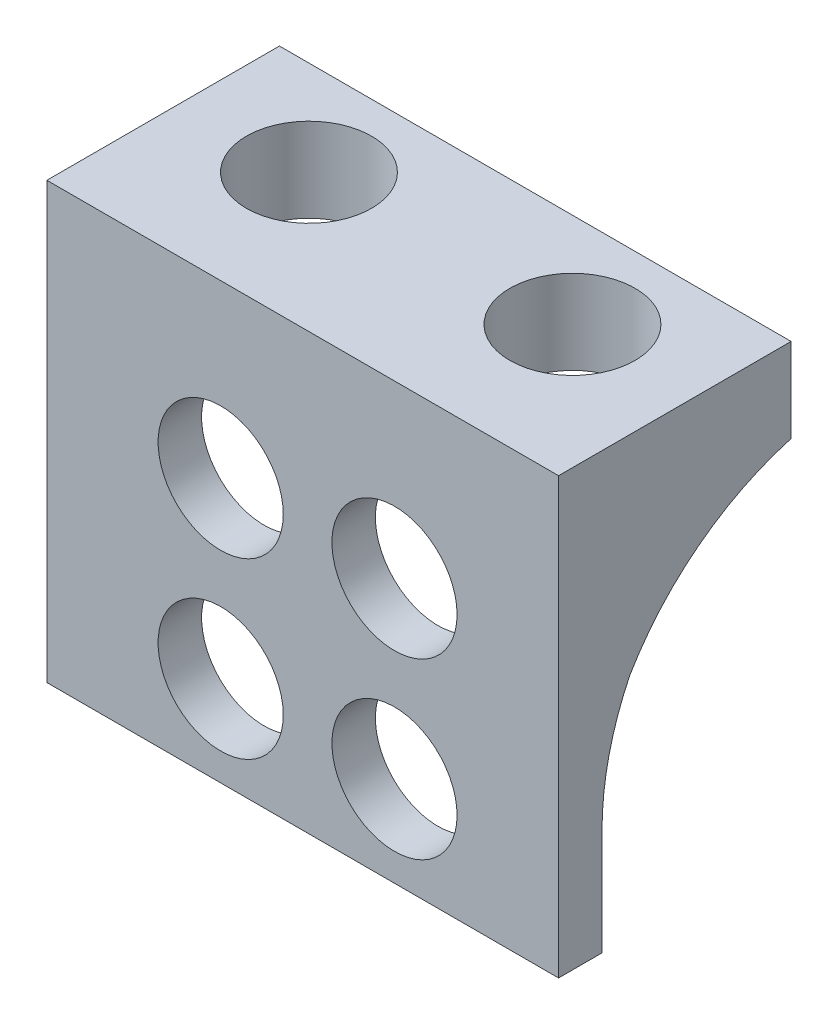
ISO-10303-21;
HEADER;
FILE_DESCRIPTION(('STEP AP214'),'2;1');
FILE_NAME('part.step','',(''),(''),'','','');
FILE_SCHEMA(('AUTOMOTIVE_DESIGN { 1 0 10303 214 1 1 1 1 }'));
ENDSEC;
DATA;
#1=APPLICATION_CONTEXT('core data for automotive mechanical design processes');
#2=APPLICATION_PROTOCOL_DEFINITION('international standard','automotive_design',2000,#1);
#3=PRODUCT_CONTEXT('',#1,'mechanical');
#4=PRODUCT('Part','Part','',(#3));
#5=PRODUCT_RELATED_PRODUCT_CATEGORY('part','',(#4));
#6=PRODUCT_DEFINITION_FORMATION('','',#4);
#7=PRODUCT_DEFINITION_CONTEXT('part definition',#1,'design');
#8=PRODUCT_DEFINITION('design','',#6,#7);
#9=PRODUCT_DEFINITION_SHAPE('','',#8);
#10=(LENGTH_UNIT() NAMED_UNIT(*) SI_UNIT(.MILLI.,.METRE.));
#11=(NAMED_UNIT(*) PLANE_ANGLE_UNIT() SI_UNIT($,.RADIAN.));
#12=(NAMED_UNIT(*) SI_UNIT($,.STERADIAN.) SOLID_ANGLE_UNIT());
#13=UNCERTAINTY_MEASURE_WITH_UNIT(LENGTH_MEASURE(1.E-05),#10,'distance_accuracy_value','');
#14=(GEOMETRIC_REPRESENTATION_CONTEXT(3) GLOBAL_UNCERTAINTY_ASSIGNED_CONTEXT((#13)) GLOBAL_UNIT_ASSIGNED_CONTEXT((#10,
#11,#12)) REPRESENTATION_CONTEXT('',''));
#15=CARTESIAN_POINT('',(0.,0.,0.));
#16=DIRECTION('',(0.,0.,1.));
#17=DIRECTION('',(1.,0.,0.));
#18=AXIS2_PLACEMENT_3D('',#15,#16,#17);
#19=CARTESIAN_POINT('',(0.,3.0734,0.));
#20=DIRECTION('',(0.,1.,0.));
#21=DIRECTION('',(0.,0.,1.));
#22=AXIS2_PLACEMENT_3D('',#19,#20,#21);
#23=PLANE('',#22);
#24=CARTESIAN_POINT('',(14.1605,3.0734,3.4544));
#25=DIRECTION('',(0.,1.,0.));
#26=DIRECTION('',(0.,0.,1.));
#27=AXIS2_PLACEMENT_3D('',#24,#25,#26);
#28=CIRCLE('',#27,2.286);
#29=CARTESIAN_POINT('',(14.1605,3.0734,5.7404));
#30=VERTEX_POINT('',#29);
#31=EDGE_CURVE('E242',#30,#30,#28,.F.);
#32=ORIENTED_EDGE('',*,*,#31,.T.);
#33=EDGE_LOOP('',(#32));
#34=FACE_BOUND('',#33,.T.);
#35=DIRECTION('',(0.,0.,1.));
#36=VECTOR('',#35,1.);
#37=CARTESIAN_POINT('',(0.,3.0734,0.));
#38=LINE('',#37,#36);
#39=CARTESIAN_POINT('',(0.,3.0734,0.));
#40=VERTEX_POINT('',#39);
#41=CARTESIAN_POINT('',(0.,3.0734,8.4963));
#42=VERTEX_POINT('',#41);
#43=EDGE_CURVE('E160',#40,#42,#38,.T.);
#44=ORIENTED_EDGE('',*,*,#43,.T.);
#45=DIRECTION('',(-1.,0.,0.));
#46=VECTOR('',#45,1.);
#47=CARTESIAN_POINT('',(0.,3.0734,8.4963));
#48=LINE('',#47,#46);
#49=CARTESIAN_POINT('',(18.6944,3.0734,8.4963));
#50=VERTEX_POINT('',#49);
#51=EDGE_CURVE('E205',#50,#42,#48,.T.);
#52=ORIENTED_EDGE('',*,*,#51,.F.);
#53=DIRECTION('',(0.,0.,-1.));
#54=VECTOR('',#53,1.);
#55=CARTESIAN_POINT('',(18.6944,3.0734,0.));
#56=LINE('',#55,#54);
#57=CARTESIAN_POINT('',(18.6944,3.0734,0.));
#58=VERTEX_POINT('',#57);
#59=EDGE_CURVE('E251',#50,#58,#56,.T.);
#60=ORIENTED_EDGE('',*,*,#59,.T.);
#61=DIRECTION('',(-1.,0.,0.));
#62=VECTOR('',#61,1.);
#63=CARTESIAN_POINT('',(0.,3.0734,0.));
#64=LINE('',#63,#62);
#65=EDGE_CURVE('E156',#58,#40,#64,.T.);
#66=ORIENTED_EDGE('',*,*,#65,.T.);
#67=EDGE_LOOP('',(#44,#52,#60,#66));
#68=FACE_BOUND('',#67,.T.);
#69=CARTESIAN_POINT('',(4.5339,3.0734,3.4544));
#70=DIRECTION('',(0.,1.,0.));
#71=DIRECTION('',(0.,0.,1.));
#72=AXIS2_PLACEMENT_3D('',#69,#70,#71);
#73=CIRCLE('',#72,2.286);
#74=CARTESIAN_POINT('',(4.5339,3.0734,5.7404));
#75=VERTEX_POINT('',#74);
#76=EDGE_CURVE('E153',#75,#75,#73,.T.);
#77=ORIENTED_EDGE('',*,*,#76,.F.);
#78=EDGE_LOOP('',(#77));
#79=FACE_BOUND('',#78,.T.);
#80=ADVANCED_FACE('F35',(#34,#68,#79),#23,.T.);
#81=CARTESIAN_POINT('',(0.,0.,0.));
#82=DIRECTION('',(0.,1.,0.));
#83=DIRECTION('',(0.,0.,1.));
#84=AXIS2_PLACEMENT_3D('',#81,#82,#83);
#85=PLANE('',#84);
#86=DIRECTION('',(0.,0.,-1.));
#87=VECTOR('',#86,1.);
#88=CARTESIAN_POINT('',(1.5875,0.,6.9088));
#89=LINE('',#88,#87);
#90=CARTESIAN_POINT('',(1.5875,0.,6.9088));
#91=VERTEX_POINT('',#90);
#92=CARTESIAN_POINT('',(1.5875,0.,0.));
#93=VERTEX_POINT('',#92);
#94=EDGE_CURVE('E119',#91,#93,#89,.T.);
#95=ORIENTED_EDGE('',*,*,#94,.T.);
#96=DIRECTION('',(-1.,0.,0.));
#97=VECTOR('',#96,1.);
#98=CARTESIAN_POINT('',(0.,0.,0.));
#99=LINE('',#98,#97);
#100=CARTESIAN_POINT('',(17.1069,0.,0.));
#101=VERTEX_POINT('',#100);
#102=EDGE_CURVE('E149',#101,#93,#99,.T.);
#103=ORIENTED_EDGE('',*,*,#102,.F.);
#104=DIRECTION('',(0.,0.,1.));
#105=VECTOR('',#104,1.);
#106=CARTESIAN_POINT('',(17.1069,0.,6.9088));
#107=LINE('',#106,#105);
#108=CARTESIAN_POINT('',(17.1069,0.,6.9088));
#109=VERTEX_POINT('',#108);
#110=EDGE_CURVE('E145',#101,#109,#107,.T.);
#111=ORIENTED_EDGE('',*,*,#110,.T.);
#112=DIRECTION('',(1.,0.,0.));
#113=VECTOR('',#112,1.);
#114=CARTESIAN_POINT('',(0.,0.,6.9088));
#115=LINE('',#114,#113);
#116=EDGE_CURVE('E137',#91,#109,#115,.T.);
#117=ORIENTED_EDGE('',*,*,#116,.F.);
#118=EDGE_LOOP('',(#95,#103,#111,#117));
#119=FACE_BOUND('',#118,.T.);
#120=CARTESIAN_POINT('',(14.1605,0.,3.4544));
#121=DIRECTION('',(0.,1.,0.));
#122=DIRECTION('',(0.,0.,1.));
#123=AXIS2_PLACEMENT_3D('',#120,#121,#122);
#124=CIRCLE('',#123,2.286);
#125=CARTESIAN_POINT('',(14.1605,0.,5.7404));
#126=VERTEX_POINT('',#125);
#127=EDGE_CURVE('E246',#126,#126,#124,.F.);
#128=ORIENTED_EDGE('',*,*,#127,.F.);
#129=EDGE_LOOP('',(#128));
#130=FACE_BOUND('',#129,.T.);
#131=CARTESIAN_POINT('',(4.5339,0.,3.4544));
#132=DIRECTION('',(0.,1.,0.));
#133=DIRECTION('',(0.,0.,1.));
#134=AXIS2_PLACEMENT_3D('',#131,#132,#133);
#135=CIRCLE('',#134,2.286);
#136=CARTESIAN_POINT('',(4.5339,0.,5.7404));
#137=VERTEX_POINT('',#136);
#138=EDGE_CURVE('E147',#137,#137,#135,.T.);
#139=ORIENTED_EDGE('',*,*,#138,.T.);
#140=EDGE_LOOP('',(#139));
#141=FACE_BOUND('',#140,.T.);
#142=ADVANCED_FACE('F143',(#119,#130,#141),#85,.F.);
#143=CARTESIAN_POINT('',(0.,3.0734,0.));
#144=DIRECTION('',(1.,0.,0.));
#145=DIRECTION('',(0.,0.,-1.));
#146=AXIS2_PLACEMENT_3D('',#143,#144,#145);
#147=PLANE('',#146);
#148=DIRECTION('',(0.,-1.,0.));
#149=VECTOR('',#148,1.);
#150=CARTESIAN_POINT('',(0.,3.0734,0.));
#151=LINE('',#150,#149);
#152=CARTESIAN_POINT('',(0.,0.,0.));
#153=VERTEX_POINT('',#152);
#154=EDGE_CURVE('E161',#40,#153,#151,.T.);
#155=ORIENTED_EDGE('',*,*,#154,.T.);
#156=CARTESIAN_POINT('',(0.,-9.62320019864165,-2.71919435437471));
#157=DIRECTION('',(1.,0.,0.));
#158=DIRECTION('',(0.,0.,-1.));
#159=AXIS2_PLACEMENT_3D('',#156,#157,#158);
#160=CIRCLE('',#159,10.);
#161=CARTESIAN_POINT('',(0.,-4.5375799471605,5.89105922247916));
#162=VERTEX_POINT('',#161);
#163=EDGE_CURVE('E174',#153,#162,#160,.T.);
#164=ORIENTED_EDGE('',*,*,#163,.T.);
#165=CARTESIAN_POINT('',(0.,-8.9329205778953,-3.0912));
#166=DIRECTION('',(1.,0.,0.));
#167=DIRECTION('',(0.,0.,-1.));
#168=AXIS2_PLACEMENT_3D('',#165,#166,#167);
#169=CIRCLE('',#168,10.);
#170=CARTESIAN_POINT('',(0.,-8.9329205778953,6.9088));
#171=VERTEX_POINT('',#170);
#172=EDGE_CURVE('E170',#162,#171,#169,.T.);
#173=ORIENTED_EDGE('',*,*,#172,.T.);
#174=DIRECTION('',(0.,-1.,0.));
#175=VECTOR('',#174,1.);
#176=CARTESIAN_POINT('',(0.,0.,6.9088));
#177=LINE('',#176,#175);
#178=CARTESIAN_POINT('',(0.,-12.8197082487724,6.9088));
#179=VERTEX_POINT('',#178);
#180=EDGE_CURVE('E141',#171,#179,#177,.T.);
#181=ORIENTED_EDGE('',*,*,#180,.T.);
#182=DIRECTION('',(0.,0.,-1.));
#183=VECTOR('',#182,1.);
#184=CARTESIAN_POINT('',(0.,-12.8197082487724,8.4963));
#185=LINE('',#184,#183);
#186=CARTESIAN_POINT('',(0.,-12.8197082487724,8.4963));
#187=VERTEX_POINT('',#186);
#188=EDGE_CURVE('E240',#187,#179,#185,.T.);
#189=ORIENTED_EDGE('',*,*,#188,.F.);
#190=DIRECTION('',(0.,-1.,0.));
#191=VECTOR('',#190,1.);
#192=CARTESIAN_POINT('',(0.,0.,8.4963));
#193=LINE('',#192,#191);
#194=EDGE_CURVE('E196',#42,#187,#193,.T.);
#195=ORIENTED_EDGE('',*,*,#194,.F.);
#196=ORIENTED_EDGE('',*,*,#43,.F.);
#197=EDGE_LOOP('',(#155,#164,#173,#181,#189,#195,#196));
#198=FACE_BOUND('',#197,.T.);
#199=ADVANCED_FACE('F265',(#198),#147,.F.);
#200=CARTESIAN_POINT('',(18.6944,3.0734,0.));
#201=DIRECTION('',(-1.,0.,0.));
#202=DIRECTION('',(0.,0.,1.));
#203=AXIS2_PLACEMENT_3D('',#200,#201,#202);
#204=PLANE('',#203);
#205=DIRECTION('',(0.,-1.,0.));
#206=VECTOR('',#205,1.);
#207=CARTESIAN_POINT('',(18.6944,0.,6.9088));
#208=LINE('',#207,#206);
#209=CARTESIAN_POINT('',(18.6944,-8.9329205778953,6.9088));
#210=VERTEX_POINT('',#209);
#211=CARTESIAN_POINT('',(18.6944,-12.8197082487724,6.9088));
#212=VERTEX_POINT('',#211);
#213=EDGE_CURVE('E225',#210,#212,#208,.T.);
#214=ORIENTED_EDGE('',*,*,#213,.F.);
#215=CARTESIAN_POINT('',(18.6944,-8.9329205778953,-3.0912));
#216=DIRECTION('',(-1.,0.,0.));
#217=DIRECTION('',(0.,0.,1.));
#218=AXIS2_PLACEMENT_3D('',#215,#216,#217);
#219=CIRCLE('',#218,10.);
#220=CARTESIAN_POINT('',(18.6944,-4.53757994716041,5.89105922247911));
#221=VERTEX_POINT('',#220);
#222=EDGE_CURVE('E44',#210,#221,#219,.T.);
#223=ORIENTED_EDGE('',*,*,#222,.T.);
#224=CARTESIAN_POINT('',(18.6944,-9.62320019864165,-2.7191943543747));
#225=DIRECTION('',(-1.,0.,0.));
#226=DIRECTION('',(0.,0.,1.));
#227=AXIS2_PLACEMENT_3D('',#224,#225,#226);
#228=CIRCLE('',#227,10.);
#229=CARTESIAN_POINT('',(18.6944,0.,0.));
#230=VERTEX_POINT('',#229);
#231=EDGE_CURVE('E177',#221,#230,#228,.T.);
#232=ORIENTED_EDGE('',*,*,#231,.T.);
#233=DIRECTION('',(0.,-1.,0.));
#234=VECTOR('',#233,1.);
#235=CARTESIAN_POINT('',(18.6944,3.0734,0.));
#236=LINE('',#235,#234);
#237=EDGE_CURVE('E164',#58,#230,#236,.T.);
#238=ORIENTED_EDGE('',*,*,#237,.F.);
#239=ORIENTED_EDGE('',*,*,#59,.F.);
#240=DIRECTION('',(0.,-1.,0.));
#241=VECTOR('',#240,1.);
#242=CARTESIAN_POINT('',(18.6944,0.,8.4963));
#243=LINE('',#242,#241);
#244=CARTESIAN_POINT('',(18.6944,-12.8197082487724,8.4963));
#245=VERTEX_POINT('',#244);
#246=EDGE_CURVE('E202',#50,#245,#243,.T.);
#247=ORIENTED_EDGE('',*,*,#246,.T.);
#248=DIRECTION('',(0.,0.,-1.));
#249=VECTOR('',#248,1.);
#250=CARTESIAN_POINT('',(18.6944,-12.8197082487724,8.4963));
#251=LINE('',#250,#249);
#252=EDGE_CURVE('E220',#245,#212,#251,.T.);
#253=ORIENTED_EDGE('',*,*,#252,.T.);
#254=EDGE_LOOP('',(#214,#223,#232,#238,#239,#247,#253));
#255=FACE_BOUND('',#254,.T.);
#256=ADVANCED_FACE('F272',(#255),#204,.F.);
#257=CARTESIAN_POINT('',(0.,3.0734,0.));
#258=DIRECTION('',(0.,0.,1.));
#259=DIRECTION('',(1.,0.,0.));
#260=AXIS2_PLACEMENT_3D('',#257,#258,#259);
#261=PLANE('',#260);
#262=EDGE_CURVE('E151',#230,#101,#99,.T.);
#263=ORIENTED_EDGE('',*,*,#262,.T.);
#264=ORIENTED_EDGE('',*,*,#102,.T.);
#265=EDGE_CURVE('E146',#93,#153,#99,.T.);
#266=ORIENTED_EDGE('',*,*,#265,.T.);
#267=ORIENTED_EDGE('',*,*,#154,.F.);
#268=ORIENTED_EDGE('',*,*,#65,.F.);
#269=ORIENTED_EDGE('',*,*,#237,.T.);
#270=EDGE_LOOP('',(#263,#264,#266,#267,#268,#269));
#271=FACE_BOUND('',#270,.T.);
#272=ADVANCED_FACE('F260',(#271),#261,.F.);
#273=CARTESIAN_POINT('',(14.1605,0.,3.4544));
#274=DIRECTION('',(0.,1.,0.));
#275=DIRECTION('',(0.,0.,1.));
#276=AXIS2_PLACEMENT_3D('',#273,#274,#275);
#277=CYLINDRICAL_SURFACE('',#276,2.286);
#278=ORIENTED_EDGE('',*,*,#127,.T.);
#279=EDGE_LOOP('',(#278));
#280=FACE_BOUND('',#279,.T.);
#281=ORIENTED_EDGE('',*,*,#31,.F.);
#282=EDGE_LOOP('',(#281));
#283=FACE_BOUND('',#282,.T.);
#284=ADVANCED_FACE('F293',(#280,#283),#277,.F.);
#285=CARTESIAN_POINT('',(4.5339,0.,3.4544));
#286=DIRECTION('',(0.,1.,0.));
#287=DIRECTION('',(0.,0.,1.));
#288=AXIS2_PLACEMENT_3D('',#285,#286,#287);
#289=CYLINDRICAL_SURFACE('',#288,2.286);
#290=ORIENTED_EDGE('',*,*,#138,.F.);
#291=EDGE_LOOP('',(#290));
#292=FACE_BOUND('',#291,.T.);
#293=ORIENTED_EDGE('',*,*,#76,.T.);
#294=EDGE_LOOP('',(#293));
#295=FACE_BOUND('',#294,.T.);
#296=ADVANCED_FACE('F319',(#292,#295),#289,.F.);
#297=CARTESIAN_POINT('',(0.,0.,6.9088));
#298=DIRECTION('',(0.,0.,1.));
#299=DIRECTION('',(1.,0.,0.));
#300=AXIS2_PLACEMENT_3D('',#297,#298,#299);
#301=PLANE('',#300);
#302=CARTESIAN_POINT('',(12.7,-9.525,6.9088));
#303=DIRECTION('',(0.,0.,1.));
#304=DIRECTION('',(1.,0.,0.));
#305=AXIS2_PLACEMENT_3D('',#302,#303,#304);
#306=CIRCLE('',#305,2.286);
#307=CARTESIAN_POINT('',(14.986,-9.525,6.9088));
#308=VERTEX_POINT('',#307);
#309=EDGE_CURVE('E227',#308,#308,#306,.F.);
#310=ORIENTED_EDGE('',*,*,#309,.F.);
#311=EDGE_LOOP('',(#310));
#312=FACE_BOUND('',#311,.T.);
#313=CARTESIAN_POINT('',(6.35,-9.525,6.9088));
#314=DIRECTION('',(0.,0.,1.));
#315=DIRECTION('',(1.,0.,0.));
#316=AXIS2_PLACEMENT_3D('',#313,#314,#315);
#317=CIRCLE('',#316,2.286);
#318=CARTESIAN_POINT('',(8.636,-9.525,6.9088));
#319=VERTEX_POINT('',#318);
#320=EDGE_CURVE('E230',#319,#319,#317,.F.);
#321=ORIENTED_EDGE('',*,*,#320,.F.);
#322=EDGE_LOOP('',(#321));
#323=FACE_BOUND('',#322,.T.);
#324=CARTESIAN_POINT('',(6.35,-3.175,6.9088));
#325=DIRECTION('',(0.,0.,1.));
#326=DIRECTION('',(1.,0.,0.));
#327=AXIS2_PLACEMENT_3D('',#324,#325,#326);
#328=CIRCLE('',#327,2.286);
#329=CARTESIAN_POINT('',(8.636,-3.175,6.9088));
#330=VERTEX_POINT('',#329);
#331=EDGE_CURVE('E233',#330,#330,#328,.T.);
#332=ORIENTED_EDGE('',*,*,#331,.T.);
#333=EDGE_LOOP('',(#332));
#334=FACE_BOUND('',#333,.T.);
#335=CARTESIAN_POINT('',(12.7,-3.175,6.9088));
#336=DIRECTION('',(0.,0.,1.));
#337=DIRECTION('',(1.,0.,0.));
#338=AXIS2_PLACEMENT_3D('',#335,#336,#337);
#339=CIRCLE('',#338,2.286);
#340=CARTESIAN_POINT('',(14.986,-3.175,6.9088));
#341=VERTEX_POINT('',#340);
#342=EDGE_CURVE('E200',#341,#341,#339,.T.);
#343=ORIENTED_EDGE('',*,*,#342,.T.);
#344=EDGE_LOOP('',(#343));
#345=FACE_BOUND('',#344,.T.);
#346=ORIENTED_EDGE('',*,*,#180,.F.);
#347=DIRECTION('',(-1.,0.,0.));
#348=VECTOR('',#347,1.);
#349=CARTESIAN_POINT('',(0.,-8.9329205778953,6.9088));
#350=LINE('',#349,#348);
#351=CARTESIAN_POINT('',(1.5875,-8.9329205778953,6.9088));
#352=VERTEX_POINT('',#351);
#353=EDGE_CURVE('E140',#171,#352,#350,.F.);
#354=ORIENTED_EDGE('',*,*,#353,.T.);
#355=DIRECTION('',(0.,1.,0.));
#356=VECTOR('',#355,1.);
#357=CARTESIAN_POINT('',(1.5875,-6.40985412438621,6.9088));
#358=LINE('',#357,#356);
#359=EDGE_CURVE('E122',#352,#91,#358,.T.);
#360=ORIENTED_EDGE('',*,*,#359,.T.);
#361=ORIENTED_EDGE('',*,*,#116,.T.);
#362=DIRECTION('',(0.,-1.,0.));
#363=VECTOR('',#362,1.);
#364=CARTESIAN_POINT('',(17.1069,-6.40985412438621,6.9088));
#365=LINE('',#364,#363);
#366=CARTESIAN_POINT('',(17.1069,-8.9329205778953,6.9088));
#367=VERTEX_POINT('',#366);
#368=EDGE_CURVE('E130',#109,#367,#365,.T.);
#369=ORIENTED_EDGE('',*,*,#368,.T.);
#370=DIRECTION('',(1.,0.,0.));
#371=VECTOR('',#370,1.);
#372=CARTESIAN_POINT('',(0.,-8.93292057789528,6.9088));
#373=LINE('',#372,#371);
#374=EDGE_CURVE('E167',#367,#210,#373,.T.);
#375=ORIENTED_EDGE('',*,*,#374,.T.);
#376=ORIENTED_EDGE('',*,*,#213,.T.);
#377=DIRECTION('',(1.,0.,0.));
#378=VECTOR('',#377,1.);
#379=CARTESIAN_POINT('',(0.,-12.8197082487724,6.9088));
#380=LINE('',#379,#378);
#381=EDGE_CURVE('E222',#179,#212,#380,.T.);
#382=ORIENTED_EDGE('',*,*,#381,.F.);
#383=EDGE_LOOP('',(#346,#354,#360,#361,#369,#375,#376,#382));
#384=FACE_BOUND('',#383,.T.);
#385=ADVANCED_FACE('F136',(#312,#323,#334,#345,#384),#301,.F.);
#386=CARTESIAN_POINT('',(0.,-12.8197082487724,8.4963));
#387=DIRECTION('',(0.,1.,0.));
#388=DIRECTION('',(0.,0.,1.));
#389=AXIS2_PLACEMENT_3D('',#386,#387,#388);
#390=PLANE('',#389);
#391=ORIENTED_EDGE('',*,*,#381,.T.);
#392=ORIENTED_EDGE('',*,*,#252,.F.);
#393=DIRECTION('',(1.,0.,0.));
#394=VECTOR('',#393,1.);
#395=CARTESIAN_POINT('',(0.,-12.8197082487724,8.4963));
#396=LINE('',#395,#394);
#397=EDGE_CURVE('E199',#187,#245,#396,.T.);
#398=ORIENTED_EDGE('',*,*,#397,.F.);
#399=ORIENTED_EDGE('',*,*,#188,.T.);
#400=EDGE_LOOP('',(#391,#392,#398,#399));
#401=FACE_BOUND('',#400,.T.);
#402=ADVANCED_FACE('F331',(#401),#390,.F.);
#403=CARTESIAN_POINT('',(6.35,-3.175,8.4963));
#404=DIRECTION('',(0.,0.,-1.));
#405=DIRECTION('',(-1.,0.,0.));
#406=AXIS2_PLACEMENT_3D('',#403,#404,#405);
#407=CYLINDRICAL_SURFACE('',#406,2.286);
#408=CARTESIAN_POINT('',(6.35,-3.175,8.4963));
#409=DIRECTION('',(0.,0.,1.));
#410=DIRECTION('',(1.,0.,0.));
#411=AXIS2_PLACEMENT_3D('',#408,#409,#410);
#412=CIRCLE('',#411,2.286);
#413=CARTESIAN_POINT('',(8.636,-3.175,8.4963));
#414=VERTEX_POINT('',#413);
#415=EDGE_CURVE('E214',#414,#414,#412,.T.);
#416=ORIENTED_EDGE('',*,*,#415,.T.);
#417=EDGE_LOOP('',(#416));
#418=FACE_BOUND('',#417,.T.);
#419=ORIENTED_EDGE('',*,*,#331,.F.);
#420=EDGE_LOOP('',(#419));
#421=FACE_BOUND('',#420,.T.);
#422=ADVANCED_FACE('F340',(#418,#421),#407,.F.);
#423=CARTESIAN_POINT('',(6.35,-9.525,8.4963));
#424=DIRECTION('',(0.,0.,-1.));
#425=DIRECTION('',(-1.,0.,0.));
#426=AXIS2_PLACEMENT_3D('',#423,#424,#425);
#427=CYLINDRICAL_SURFACE('',#426,2.286);
#428=CARTESIAN_POINT('',(6.35,-9.525,8.4963));
#429=DIRECTION('',(0.,0.,1.));
#430=DIRECTION('',(1.,0.,0.));
#431=AXIS2_PLACEMENT_3D('',#428,#429,#430);
#432=CIRCLE('',#431,2.286);
#433=CARTESIAN_POINT('',(8.636,-9.525,8.4963));
#434=VERTEX_POINT('',#433);
#435=EDGE_CURVE('E211',#434,#434,#432,.F.);
#436=ORIENTED_EDGE('',*,*,#435,.F.);
#437=EDGE_LOOP('',(#436));
#438=FACE_BOUND('',#437,.T.);
#439=ORIENTED_EDGE('',*,*,#320,.T.);
#440=EDGE_LOOP('',(#439));
#441=FACE_BOUND('',#440,.T.);
#442=ADVANCED_FACE('F348',(#438,#441),#427,.F.);
#443=CARTESIAN_POINT('',(12.7,-9.525,8.4963));
#444=DIRECTION('',(0.,0.,-1.));
#445=DIRECTION('',(-1.,0.,0.));
#446=AXIS2_PLACEMENT_3D('',#443,#444,#445);
#447=CYLINDRICAL_SURFACE('',#446,2.286);
#448=CARTESIAN_POINT('',(12.7,-9.525,8.4963));
#449=DIRECTION('',(0.,0.,1.));
#450=DIRECTION('',(1.,0.,0.));
#451=AXIS2_PLACEMENT_3D('',#448,#449,#450);
#452=CIRCLE('',#451,2.286);
#453=CARTESIAN_POINT('',(14.986,-9.525,8.4963));
#454=VERTEX_POINT('',#453);
#455=EDGE_CURVE('E208',#454,#454,#452,.F.);
#456=ORIENTED_EDGE('',*,*,#455,.F.);
#457=EDGE_LOOP('',(#456));
#458=FACE_BOUND('',#457,.T.);
#459=ORIENTED_EDGE('',*,*,#309,.T.);
#460=EDGE_LOOP('',(#459));
#461=FACE_BOUND('',#460,.T.);
#462=ADVANCED_FACE('F356',(#458,#461),#447,.F.);
#463=CARTESIAN_POINT('',(12.7,-3.175,8.4963));
#464=DIRECTION('',(0.,0.,-1.));
#465=DIRECTION('',(-1.,0.,0.));
#466=AXIS2_PLACEMENT_3D('',#463,#464,#465);
#467=CYLINDRICAL_SURFACE('',#466,2.286);
#468=CARTESIAN_POINT('',(12.7,-3.175,8.4963));
#469=DIRECTION('',(0.,0.,1.));
#470=DIRECTION('',(1.,0.,0.));
#471=AXIS2_PLACEMENT_3D('',#468,#469,#470);
#472=CIRCLE('',#471,2.286);
#473=CARTESIAN_POINT('',(14.986,-3.175,8.4963));
#474=VERTEX_POINT('',#473);
#475=EDGE_CURVE('E217',#474,#474,#472,.T.);
#476=ORIENTED_EDGE('',*,*,#475,.T.);
#477=EDGE_LOOP('',(#476));
#478=FACE_BOUND('',#477,.T.);
#479=ORIENTED_EDGE('',*,*,#342,.F.);
#480=EDGE_LOOP('',(#479));
#481=FACE_BOUND('',#480,.T.);
#482=ADVANCED_FACE('F364',(#478,#481),#467,.F.);
#483=CARTESIAN_POINT('',(0.,0.,8.4963));
#484=DIRECTION('',(0.,0.,1.));
#485=DIRECTION('',(1.,0.,0.));
#486=AXIS2_PLACEMENT_3D('',#483,#484,#485);
#487=PLANE('',#486);
#488=ORIENTED_EDGE('',*,*,#194,.T.);
#489=ORIENTED_EDGE('',*,*,#397,.T.);
#490=ORIENTED_EDGE('',*,*,#246,.F.);
#491=ORIENTED_EDGE('',*,*,#51,.T.);
#492=EDGE_LOOP('',(#488,#489,#490,#491));
#493=FACE_BOUND('',#492,.T.);
#494=ORIENTED_EDGE('',*,*,#455,.T.);
#495=EDGE_LOOP('',(#494));
#496=FACE_BOUND('',#495,.T.);
#497=ORIENTED_EDGE('',*,*,#435,.T.);
#498=EDGE_LOOP('',(#497));
#499=FACE_BOUND('',#498,.T.);
#500=ORIENTED_EDGE('',*,*,#415,.F.);
#501=EDGE_LOOP('',(#500));
#502=FACE_BOUND('',#501,.T.);
#503=ORIENTED_EDGE('',*,*,#475,.F.);
#504=EDGE_LOOP('',(#503));
#505=FACE_BOUND('',#504,.T.);
#506=ADVANCED_FACE('F268',(#493,#496,#499,#502,#505),#487,.T.);
#507=CARTESIAN_POINT('',(1.5875,0.,0.));
#508=DIRECTION('',(1.,0.,0.));
#509=DIRECTION('',(0.,0.,-1.));
#510=AXIS2_PLACEMENT_3D('',#507,#508,#509);
#511=PLANE('',#510);
#512=ORIENTED_EDGE('',*,*,#94,.F.);
#513=ORIENTED_EDGE('',*,*,#359,.F.);
#514=CARTESIAN_POINT('',(1.5875,-8.9329205778953,-3.0912));
#515=DIRECTION('',(1.,0.,0.));
#516=DIRECTION('',(0.,0.,-1.));
#517=AXIS2_PLACEMENT_3D('',#514,#515,#516);
#518=CIRCLE('',#517,10.);
#519=CARTESIAN_POINT('',(1.5875,-4.5375799471605,5.89105922247916));
#520=VERTEX_POINT('',#519);
#521=EDGE_CURVE('E172',#352,#520,#518,.F.);
#522=ORIENTED_EDGE('',*,*,#521,.T.);
#523=CARTESIAN_POINT('',(1.5875,-9.62320019864165,-2.71919435437471));
#524=DIRECTION('',(1.,0.,0.));
#525=DIRECTION('',(0.,0.,-1.));
#526=AXIS2_PLACEMENT_3D('',#523,#524,#525);
#527=CIRCLE('',#526,10.);
#528=EDGE_CURVE('E125',#520,#93,#527,.F.);
#529=ORIENTED_EDGE('',*,*,#528,.T.);
#530=EDGE_LOOP('',(#512,#513,#522,#529));
#531=FACE_BOUND('',#530,.T.);
#532=ADVANCED_FACE('F121',(#531),#511,.T.);
#533=CARTESIAN_POINT('',(17.1069,0.,0.));
#534=DIRECTION('',(1.,0.,0.));
#535=DIRECTION('',(0.,0.,-1.));
#536=AXIS2_PLACEMENT_3D('',#533,#534,#535);
#537=PLANE('',#536);
#538=ORIENTED_EDGE('',*,*,#110,.F.);
#539=CARTESIAN_POINT('',(17.1069,-9.62320019864165,-2.7191943543747));
#540=DIRECTION('',(1.,0.,0.));
#541=DIRECTION('',(0.,0.,-1.));
#542=AXIS2_PLACEMENT_3D('',#539,#540,#541);
#543=CIRCLE('',#542,10.);
#544=CARTESIAN_POINT('',(17.1069,-4.53757994716042,5.89105922247912));
#545=VERTEX_POINT('',#544);
#546=EDGE_CURVE('E51',#101,#545,#543,.T.);
#547=ORIENTED_EDGE('',*,*,#546,.T.);
#548=CARTESIAN_POINT('',(17.1069,-8.9329205778953,-3.0912));
#549=DIRECTION('',(1.,0.,0.));
#550=DIRECTION('',(0.,0.,-1.));
#551=AXIS2_PLACEMENT_3D('',#548,#549,#550);
#552=CIRCLE('',#551,10.);
#553=EDGE_CURVE('E11',#545,#367,#552,.T.);
#554=ORIENTED_EDGE('',*,*,#553,.T.);
#555=ORIENTED_EDGE('',*,*,#368,.F.);
#556=EDGE_LOOP('',(#538,#547,#554,#555));
#557=FACE_BOUND('',#556,.T.);
#558=ADVANCED_FACE('F193',(#557),#537,.F.);
#559=CARTESIAN_POINT('',(0.,-9.62320019864165,-2.71919435437471));
#560=DIRECTION('',(1.,0.,0.));
#561=DIRECTION('',(0.,0.,-1.));
#562=AXIS2_PLACEMENT_3D('',#559,#560,#561);
#563=CYLINDRICAL_SURFACE('',#562,10.);
#564=ORIENTED_EDGE('',*,*,#265,.F.);
#565=ORIENTED_EDGE('',*,*,#528,.F.);
#566=DIRECTION('',(1.,0.,0.));
#567=VECTOR('',#566,1.);
#568=CARTESIAN_POINT('',(0.79375,-4.5375799471605,5.89105922247915));
#569=LINE('',#568,#567);
#570=EDGE_CURVE('E180',#162,#520,#569,.T.);
#571=ORIENTED_EDGE('',*,*,#570,.F.);
#572=ORIENTED_EDGE('',*,*,#163,.F.);
#573=EDGE_LOOP('',(#564,#565,#571,#572));
#574=FACE_BOUND('',#573,.T.);
#575=ADVANCED_FACE('F274',(#574),#563,.F.);
#576=CARTESIAN_POINT('',(1.5875,-8.9329205778953,-3.0912));
#577=DIRECTION('',(-1.,0.,0.));
#578=DIRECTION('',(0.,-1.,0.));
#579=AXIS2_PLACEMENT_3D('',#576,#577,#578);
#580=CYLINDRICAL_SURFACE('',#579,10.);
#581=ORIENTED_EDGE('',*,*,#521,.F.);
#582=ORIENTED_EDGE('',*,*,#353,.F.);
#583=ORIENTED_EDGE('',*,*,#172,.F.);
#584=ORIENTED_EDGE('',*,*,#570,.T.);
#585=EDGE_LOOP('',(#581,#582,#583,#584));
#586=FACE_BOUND('',#585,.T.);
#587=ADVANCED_FACE('F276',(#586),#580,.F.);
#588=CARTESIAN_POINT('',(0.,-8.93292057789528,-3.0912));
#589=DIRECTION('',(1.,0.,0.));
#590=DIRECTION('',(0.,1.,0.));
#591=AXIS2_PLACEMENT_3D('',#588,#589,#590);
#592=CYLINDRICAL_SURFACE('',#591,10.);
#593=ORIENTED_EDGE('',*,*,#374,.F.);
#594=ORIENTED_EDGE('',*,*,#553,.F.);
#595=DIRECTION('',(1.,0.,0.));
#596=VECTOR('',#595,1.);
#597=CARTESIAN_POINT('',(17.90065,-4.53757994716041,5.89105922247911));
#598=LINE('',#597,#596);
#599=EDGE_CURVE('E39',#221,#545,#598,.F.);
#600=ORIENTED_EDGE('',*,*,#599,.F.);
#601=ORIENTED_EDGE('',*,*,#222,.F.);
#602=EDGE_LOOP('',(#593,#594,#600,#601));
#603=FACE_BOUND('',#602,.T.);
#604=ADVANCED_FACE('F37',(#603),#592,.F.);
#605=CARTESIAN_POINT('',(0.,-9.62320019864165,-2.7191943543747));
#606=DIRECTION('',(1.,0.,0.));
#607=DIRECTION('',(0.,0.,-1.));
#608=AXIS2_PLACEMENT_3D('',#605,#606,#607);
#609=CYLINDRICAL_SURFACE('',#608,10.);
#610=ORIENTED_EDGE('',*,*,#546,.F.);
#611=ORIENTED_EDGE('',*,*,#262,.F.);
#612=ORIENTED_EDGE('',*,*,#231,.F.);
#613=ORIENTED_EDGE('',*,*,#599,.T.);
#614=EDGE_LOOP('',(#610,#611,#612,#613));
#615=FACE_BOUND('',#614,.T.);
#616=ADVANCED_FACE('F189',(#615),#609,.F.);
#617=CLOSED_SHELL('',(#80,#142,#199,#256,#272,#284,#296,#385,#402,#422,#442,#462,#482,#506,#532,
#558,#575,#587,#604,#616));
#618=MANIFOLD_SOLID_BREP('B2',#617);
#619=ADVANCED_BREP_SHAPE_REPRESENTATION('',(#18,#618),#14);
#620=SHAPE_DEFINITION_REPRESENTATION(#9,#619);
ENDSEC;
END-ISO-10303-21;
